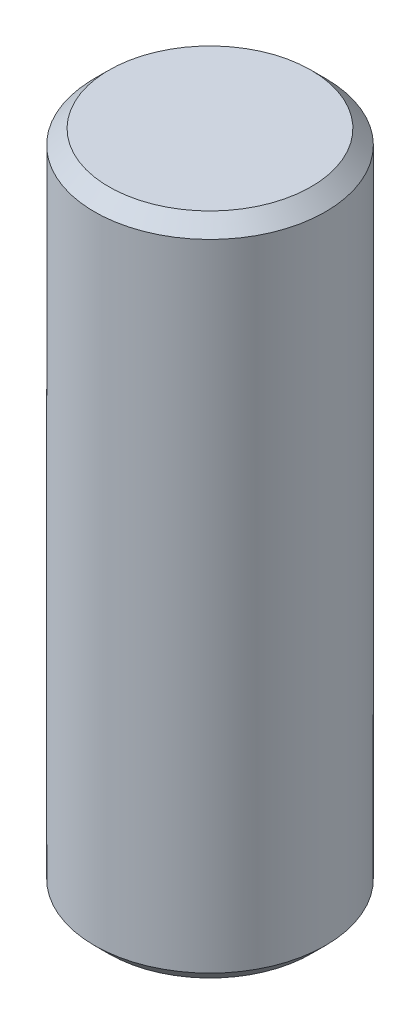
ISO-10303-21;
HEADER;
FILE_DESCRIPTION(('STEP AP214'),'2;1');
FILE_NAME('part.step','',(''),(''),'','','');
FILE_SCHEMA(('AUTOMOTIVE_DESIGN { 1 0 10303 214 1 1 1 1 }'));
ENDSEC;
DATA;
#1=APPLICATION_CONTEXT('core data for automotive mechanical design processes');
#2=APPLICATION_PROTOCOL_DEFINITION('international standard','automotive_design',2000,#1);
#3=PRODUCT_CONTEXT('',#1,'mechanical');
#4=PRODUCT('Part','Part','',(#3));
#5=PRODUCT_RELATED_PRODUCT_CATEGORY('part','',(#4));
#6=PRODUCT_DEFINITION_FORMATION('','',#4);
#7=PRODUCT_DEFINITION_CONTEXT('part definition',#1,'design');
#8=PRODUCT_DEFINITION('design','',#6,#7);
#9=PRODUCT_DEFINITION_SHAPE('','',#8);
#10=(LENGTH_UNIT() NAMED_UNIT(*) SI_UNIT(.MILLI.,.METRE.));
#11=(NAMED_UNIT(*) PLANE_ANGLE_UNIT() SI_UNIT($,.RADIAN.));
#12=(NAMED_UNIT(*) SI_UNIT($,.STERADIAN.) SOLID_ANGLE_UNIT());
#13=UNCERTAINTY_MEASURE_WITH_UNIT(LENGTH_MEASURE(1.E-05),#10,'distance_accuracy_value','');
#14=(GEOMETRIC_REPRESENTATION_CONTEXT(3) GLOBAL_UNCERTAINTY_ASSIGNED_CONTEXT((#13)) GLOBAL_UNIT_ASSIGNED_CONTEXT((#10,
#11,#12)) REPRESENTATION_CONTEXT('',''));
#15=CARTESIAN_POINT('',(0.,0.,0.));
#16=DIRECTION('',(0.,0.,1.));
#17=DIRECTION('',(1.,0.,0.));
#18=AXIS2_PLACEMENT_3D('',#15,#16,#17);
#19=CARTESIAN_POINT('',(0.,23.,0.));
#20=DIRECTION('',(0.,1.,0.));
#21=DIRECTION('',(-1.,0.,0.));
#22=AXIS2_PLACEMENT_3D('',#19,#20,#21);
#23=PLANE('',#22);
#24=CARTESIAN_POINT('',(0.,22.9999999999677,0.));
#25=DIRECTION('',(0.,-1.,0.));
#26=DIRECTION('',(0.,0.,-1.));
#27=AXIS2_PLACEMENT_3D('',#24,#25,#26);
#28=CIRCLE('',#27,3.50000000003092);
#29=CARTESIAN_POINT('',(0.,22.9999999999677,-3.50000000003092));
#30=VERTEX_POINT('',#29);
#31=EDGE_CURVE('E17',#30,#30,#28,.T.);
#32=ORIENTED_EDGE('',*,*,#31,.F.);
#33=EDGE_LOOP('',(#32));
#34=FACE_BOUND('',#33,.T.);
#35=ADVANCED_FACE('F14',(#34),#23,.T.);
#36=CARTESIAN_POINT('',(0.,0.,0.));
#37=DIRECTION('',(0.,1.,0.));
#38=DIRECTION('',(-1.,0.,0.));
#39=AXIS2_PLACEMENT_3D('',#36,#37,#38);
#40=PLANE('',#39);
#41=CARTESIAN_POINT('',(0.,0.,0.));
#42=DIRECTION('',(0.,1.,0.));
#43=DIRECTION('',(0.,0.,1.));
#44=AXIS2_PLACEMENT_3D('',#41,#42,#43);
#45=CIRCLE('',#44,3.49999999997408);
#46=CARTESIAN_POINT('',(0.,0.,3.49999999997408));
#47=VERTEX_POINT('',#46);
#48=EDGE_CURVE('E26',#47,#47,#45,.T.);
#49=ORIENTED_EDGE('',*,*,#48,.F.);
#50=EDGE_LOOP('',(#49));
#51=FACE_BOUND('',#50,.T.);
#52=ADVANCED_FACE('F37',(#51),#40,.F.);
#53=CARTESIAN_POINT('',(0.,22.5000000000932,0.));
#54=DIRECTION('',(0.,-1.,0.));
#55=DIRECTION('',(0.,0.,-1.));
#56=AXIS2_PLACEMENT_3D('',#53,#54,#55);
#57=CONICAL_SURFACE('',#56,3.99999999990541,0.785398163397448);
#58=CARTESIAN_POINT('',(0.,22.5,0.));
#59=DIRECTION('',(0.,-1.,0.));
#60=DIRECTION('',(1.,0.,0.));
#61=AXIS2_PLACEMENT_3D('',#58,#59,#60);
#62=CIRCLE('',#61,4.);
#63=CARTESIAN_POINT('',(4.,22.5,0.));
#64=VERTEX_POINT('',#63);
#65=EDGE_CURVE('E21',#64,#64,#62,.T.);
#66=ORIENTED_EDGE('',*,*,#65,.F.);
#67=EDGE_LOOP('',(#66));
#68=FACE_BOUND('',#67,.T.);
#69=ORIENTED_EDGE('',*,*,#31,.T.);
#70=EDGE_LOOP('',(#69));
#71=FACE_BOUND('',#70,.T.);
#72=ADVANCED_FACE('F34',(#68,#71),#57,.T.);
#73=CARTESIAN_POINT('',(0.,0.500000000101863,0.));
#74=DIRECTION('',(0.,1.,0.));
#75=DIRECTION('',(0.,0.,1.));
#76=AXIS2_PLACEMENT_3D('',#73,#74,#75);
#77=CONICAL_SURFACE('',#76,4.0000000000191,0.785398163340605);
#78=CARTESIAN_POINT('',(0.,0.5,0.));
#79=DIRECTION('',(0.,-1.,0.));
#80=DIRECTION('',(1.,0.,0.));
#81=AXIS2_PLACEMENT_3D('',#78,#79,#80);
#82=CIRCLE('',#81,4.);
#83=CARTESIAN_POINT('',(4.,0.5,0.));
#84=VERTEX_POINT('',#83);
#85=EDGE_CURVE('E10',#84,#84,#82,.F.);
#86=ORIENTED_EDGE('',*,*,#85,.F.);
#87=EDGE_LOOP('',(#86));
#88=FACE_BOUND('',#87,.T.);
#89=ORIENTED_EDGE('',*,*,#48,.T.);
#90=EDGE_LOOP('',(#89));
#91=FACE_BOUND('',#90,.T.);
#92=ADVANCED_FACE('F45',(#88,#91),#77,.T.);
#93=CARTESIAN_POINT('',(0.,23.,0.));
#94=DIRECTION('',(0.,-1.,0.));
#95=DIRECTION('',(1.,0.,0.));
#96=AXIS2_PLACEMENT_3D('',#93,#94,#95);
#97=CYLINDRICAL_SURFACE('',#96,4.);
#98=ORIENTED_EDGE('',*,*,#85,.T.);
#99=EDGE_LOOP('',(#98));
#100=FACE_BOUND('',#99,.T.);
#101=ORIENTED_EDGE('',*,*,#65,.T.);
#102=EDGE_LOOP('',(#101));
#103=FACE_BOUND('',#102,.T.);
#104=ADVANCED_FACE('F43',(#100,#103),#97,.T.);
#105=CLOSED_SHELL('',(#35,#52,#72,#92,#104));
#106=MANIFOLD_SOLID_BREP('B1',#105);
#107=ADVANCED_BREP_SHAPE_REPRESENTATION('',(#18,#106),#14);
#108=SHAPE_DEFINITION_REPRESENTATION(#9,#107);
ENDSEC;
END-ISO-10303-21;
